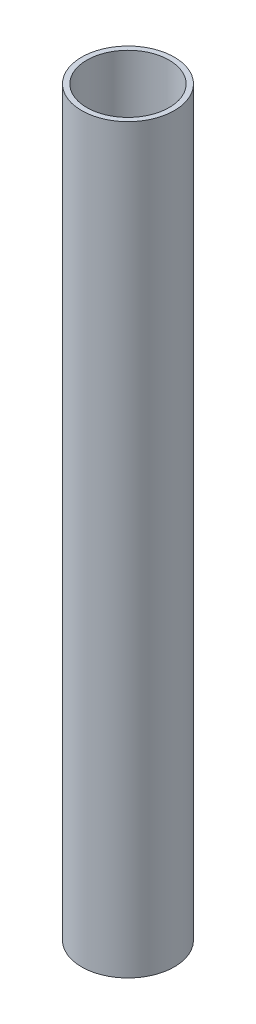
ISO-10303-21;
HEADER;
FILE_DESCRIPTION(('STEP AP214'),'2;1');
FILE_NAME('part.step','',(''),(''),'','','');
FILE_SCHEMA(('AUTOMOTIVE_DESIGN { 1 0 10303 214 1 1 1 1 }'));
ENDSEC;
DATA;
#1=APPLICATION_CONTEXT('core data for automotive mechanical design processes');
#2=APPLICATION_PROTOCOL_DEFINITION('international standard','automotive_design',2000,#1);
#3=PRODUCT_CONTEXT('',#1,'mechanical');
#4=PRODUCT('Part','Part','',(#3));
#5=PRODUCT_RELATED_PRODUCT_CATEGORY('part','',(#4));
#6=PRODUCT_DEFINITION_FORMATION('','',#4);
#7=PRODUCT_DEFINITION_CONTEXT('part definition',#1,'design');
#8=PRODUCT_DEFINITION('design','',#6,#7);
#9=PRODUCT_DEFINITION_SHAPE('','',#8);
#10=(LENGTH_UNIT() NAMED_UNIT(*) SI_UNIT(.MILLI.,.METRE.));
#11=(NAMED_UNIT(*) PLANE_ANGLE_UNIT() SI_UNIT($,.RADIAN.));
#12=(NAMED_UNIT(*) SI_UNIT($,.STERADIAN.) SOLID_ANGLE_UNIT());
#13=UNCERTAINTY_MEASURE_WITH_UNIT(LENGTH_MEASURE(1.E-05),#10,'distance_accuracy_value','');
#14=(GEOMETRIC_REPRESENTATION_CONTEXT(3) GLOBAL_UNCERTAINTY_ASSIGNED_CONTEXT((#13)) GLOBAL_UNIT_ASSIGNED_CONTEXT((#10,
#11,#12)) REPRESENTATION_CONTEXT('',''));
#15=CARTESIAN_POINT('',(0.,0.,0.));
#16=DIRECTION('',(0.,0.,1.));
#17=DIRECTION('',(1.,0.,0.));
#18=AXIS2_PLACEMENT_3D('',#15,#16,#17);
#19=CARTESIAN_POINT('',(0.,101.6,0.));
#20=DIRECTION('',(0.,1.,0.));
#21=DIRECTION('',(0.,0.,1.));
#22=AXIS2_PLACEMENT_3D('',#19,#20,#21);
#23=PLANE('',#22);
#24=CARTESIAN_POINT('',(0.,101.6,0.));
#25=DIRECTION('',(0.,1.,0.));
#26=DIRECTION('',(0.,0.,1.));
#27=AXIS2_PLACEMENT_3D('',#24,#25,#26);
#28=CIRCLE('',#27,6.35);
#29=CARTESIAN_POINT('',(0.,101.6,6.35));
#30=VERTEX_POINT('',#29);
#31=EDGE_CURVE('E10',#30,#30,#28,.T.);
#32=ORIENTED_EDGE('',*,*,#31,.T.);
#33=EDGE_LOOP('',(#32));
#34=FACE_BOUND('',#33,.T.);
#35=CARTESIAN_POINT('',(0.,101.6,0.));
#36=DIRECTION('',(0.,1.,0.));
#37=DIRECTION('',(0.,0.,1.));
#38=AXIS2_PLACEMENT_3D('',#35,#36,#37);
#39=CIRCLE('',#38,5.6388);
#40=CARTESIAN_POINT('',(0.,101.6,5.6388));
#41=VERTEX_POINT('',#40);
#42=EDGE_CURVE('E42',#41,#41,#39,.T.);
#43=ORIENTED_EDGE('',*,*,#42,.F.);
#44=EDGE_LOOP('',(#43));
#45=FACE_BOUND('',#44,.T.);
#46=ADVANCED_FACE('F31',(#34,#45),#23,.T.);
#47=CARTESIAN_POINT('',(0.,0.,0.));
#48=DIRECTION('',(0.,1.,0.));
#49=DIRECTION('',(0.,0.,1.));
#50=AXIS2_PLACEMENT_3D('',#47,#48,#49);
#51=PLANE('',#50);
#52=CARTESIAN_POINT('',(0.,0.,0.));
#53=DIRECTION('',(0.,1.,0.));
#54=DIRECTION('',(0.,0.,1.));
#55=AXIS2_PLACEMENT_3D('',#52,#53,#54);
#56=CIRCLE('',#55,6.35);
#57=CARTESIAN_POINT('',(0.,0.,6.35));
#58=VERTEX_POINT('',#57);
#59=EDGE_CURVE('E35',#58,#58,#56,.T.);
#60=ORIENTED_EDGE('',*,*,#59,.F.);
#61=EDGE_LOOP('',(#60));
#62=FACE_BOUND('',#61,.T.);
#63=CARTESIAN_POINT('',(0.,0.,0.));
#64=DIRECTION('',(0.,1.,0.));
#65=DIRECTION('',(0.,0.,1.));
#66=AXIS2_PLACEMENT_3D('',#63,#64,#65);
#67=CIRCLE('',#66,5.6388);
#68=CARTESIAN_POINT('',(0.,0.,5.6388));
#69=VERTEX_POINT('',#68);
#70=EDGE_CURVE('E44',#69,#69,#67,.T.);
#71=ORIENTED_EDGE('',*,*,#70,.T.);
#72=EDGE_LOOP('',(#71));
#73=FACE_BOUND('',#72,.T.);
#74=ADVANCED_FACE('F54',(#62,#73),#51,.F.);
#75=CARTESIAN_POINT('',(0.,101.6,0.));
#76=DIRECTION('',(0.,-1.,0.));
#77=DIRECTION('',(0.,0.,-1.));
#78=AXIS2_PLACEMENT_3D('',#75,#76,#77);
#79=CYLINDRICAL_SURFACE('',#78,6.35);
#80=ORIENTED_EDGE('',*,*,#31,.F.);
#81=EDGE_LOOP('',(#80));
#82=FACE_BOUND('',#81,.T.);
#83=ORIENTED_EDGE('',*,*,#59,.T.);
#84=EDGE_LOOP('',(#83));
#85=FACE_BOUND('',#84,.T.);
#86=ADVANCED_FACE('F33',(#82,#85),#79,.T.);
#87=CARTESIAN_POINT('',(0.,101.6,0.));
#88=DIRECTION('',(0.,-1.,0.));
#89=DIRECTION('',(0.,0.,-1.));
#90=AXIS2_PLACEMENT_3D('',#87,#88,#89);
#91=CYLINDRICAL_SURFACE('',#90,5.6388);
#92=ORIENTED_EDGE('',*,*,#42,.T.);
#93=EDGE_LOOP('',(#92));
#94=FACE_BOUND('',#93,.T.);
#95=ORIENTED_EDGE('',*,*,#70,.F.);
#96=EDGE_LOOP('',(#95));
#97=FACE_BOUND('',#96,.T.);
#98=ADVANCED_FACE('F50',(#94,#97),#91,.F.);
#99=CLOSED_SHELL('',(#46,#74,#86,#98));
#100=MANIFOLD_SOLID_BREP('B2',#99);
#101=ADVANCED_BREP_SHAPE_REPRESENTATION('',(#18,#100),#14);
#102=SHAPE_DEFINITION_REPRESENTATION(#9,#101);
ENDSEC;
END-ISO-10303-21;
